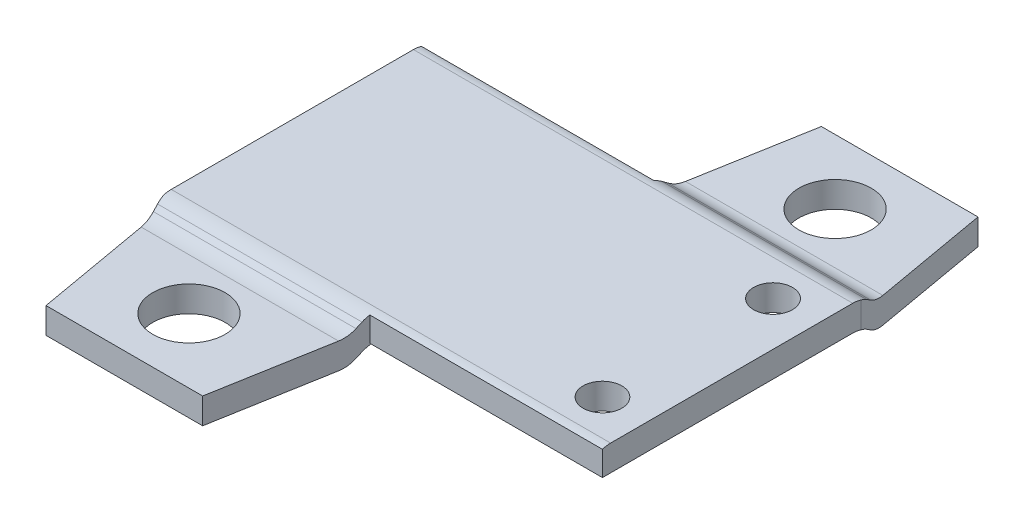
ISO-10303-21;
HEADER;
FILE_DESCRIPTION(('STEP AP214'),'2;1');
FILE_NAME('part.step','',(''),(''),'','','');
FILE_SCHEMA(('AUTOMOTIVE_DESIGN { 1 0 10303 214 1 1 1 1 }'));
ENDSEC;
DATA;
#1=APPLICATION_CONTEXT('core data for automotive mechanical design processes');
#2=APPLICATION_PROTOCOL_DEFINITION('international standard','automotive_design',2000,#1);
#3=PRODUCT_CONTEXT('',#1,'mechanical');
#4=PRODUCT('Part','Part','',(#3));
#5=PRODUCT_RELATED_PRODUCT_CATEGORY('part','',(#4));
#6=PRODUCT_DEFINITION_FORMATION('','',#4);
#7=PRODUCT_DEFINITION_CONTEXT('part definition',#1,'design');
#8=PRODUCT_DEFINITION('design','',#6,#7);
#9=PRODUCT_DEFINITION_SHAPE('','',#8);
#10=(LENGTH_UNIT() NAMED_UNIT(*) SI_UNIT(.MILLI.,.METRE.));
#11=(NAMED_UNIT(*) PLANE_ANGLE_UNIT() SI_UNIT($,.RADIAN.));
#12=(NAMED_UNIT(*) SI_UNIT($,.STERADIAN.) SOLID_ANGLE_UNIT());
#13=UNCERTAINTY_MEASURE_WITH_UNIT(LENGTH_MEASURE(1.E-05),#10,'distance_accuracy_value','');
#14=(GEOMETRIC_REPRESENTATION_CONTEXT(3) GLOBAL_UNCERTAINTY_ASSIGNED_CONTEXT((#13)) GLOBAL_UNIT_ASSIGNED_CONTEXT((#10,
#11,#12)) REPRESENTATION_CONTEXT('',''));
#15=CARTESIAN_POINT('',(0.,0.,0.));
#16=DIRECTION('',(0.,0.,1.));
#17=DIRECTION('',(1.,0.,0.));
#18=AXIS2_PLACEMENT_3D('',#15,#16,#17);
#19=CARTESIAN_POINT('',(-17.,-0.500000000000001,5.71407400337107));
#20=DIRECTION('',(0.,1.,0.));
#21=DIRECTION('',(0.,0.,1.));
#22=AXIS2_PLACEMENT_3D('',#19,#20,#21);
#23=PLANE('',#22);
#24=DIRECTION('',(-0.173648177666924,0.,-0.984807753012209));
#25=VECTOR('',#24,1.);
#26=CARTESIAN_POINT('',(-17.,-0.500000000000001,5.));
#27=LINE('',#26,#25);
#28=CARTESIAN_POINT('',(-16.8184938035191,-0.500000000000001,6.02937279225005));
#29=VERTEX_POINT('',#28);
#30=CARTESIAN_POINT('',(-16.0302016061035,-0.500000000000001,10.5));
#31=VERTEX_POINT('',#30);
#32=EDGE_CURVE('E307',#29,#31,#27,.F.);
#33=ORIENTED_EDGE('',*,*,#32,.T.);
#34=DIRECTION('',(1.,0.,0.));
#35=VECTOR('',#34,1.);
#36=CARTESIAN_POINT('',(-17.,-0.500000000000001,10.5));
#37=LINE('',#36,#35);
#38=CARTESIAN_POINT('',(-9.96979839389652,-0.500000000000001,10.5));
#39=VERTEX_POINT('',#38);
#40=EDGE_CURVE('E206',#39,#31,#37,.F.);
#41=ORIENTED_EDGE('',*,*,#40,.F.);
#42=DIRECTION('',(-0.173648177666924,0.,0.984807753012209));
#43=VECTOR('',#42,1.);
#44=CARTESIAN_POINT('',(-9.,-0.5,5.));
#45=LINE('',#44,#43);
#46=CARTESIAN_POINT('',(-9.18150619648088,-0.500000000000001,6.02937279225005));
#47=VERTEX_POINT('',#46);
#48=EDGE_CURVE('E311',#39,#47,#45,.F.);
#49=ORIENTED_EDGE('',*,*,#48,.T.);
#50=DIRECTION('',(-1.,0.,0.));
#51=VECTOR('',#50,1.);
#52=CARTESIAN_POINT('',(-17.,-0.500000000000001,6.02937279225005));
#53=LINE('',#52,#51);
#54=EDGE_CURVE('E270',#47,#29,#53,.T.);
#55=ORIENTED_EDGE('',*,*,#54,.T.);
#56=EDGE_LOOP('',(#33,#41,#49,#55));
#57=FACE_BOUND('',#56,.T.);
#58=CARTESIAN_POINT('',(-13.,-0.500000000000001,8.));
#59=DIRECTION('',(0.,1.,0.));
#60=DIRECTION('',(0.,0.,1.));
#61=AXIS2_PLACEMENT_3D('',#58,#59,#60);
#62=CIRCLE('',#61,1.4);
#63=CARTESIAN_POINT('',(-13.,-0.500000000000001,9.4));
#64=VERTEX_POINT('',#63);
#65=EDGE_CURVE('E20',#64,#64,#62,.F.);
#66=ORIENTED_EDGE('',*,*,#65,.T.);
#67=EDGE_LOOP('',(#66));
#68=FACE_BOUND('',#67,.T.);
#69=ADVANCED_FACE('F17',(#57,#68),#23,.T.);
#70=CARTESIAN_POINT('',(-13.,-1.5,8.));
#71=DIRECTION('',(0.,1.,0.));
#72=DIRECTION('',(0.,0.,1.));
#73=AXIS2_PLACEMENT_3D('',#70,#71,#72);
#74=CYLINDRICAL_SURFACE('',#73,1.4);
#75=ORIENTED_EDGE('',*,*,#65,.F.);
#76=EDGE_LOOP('',(#75));
#77=FACE_BOUND('',#76,.T.);
#78=CARTESIAN_POINT('',(-13.,-1.5,8.));
#79=DIRECTION('',(0.,1.,0.));
#80=DIRECTION('',(0.,0.,1.));
#81=AXIS2_PLACEMENT_3D('',#78,#79,#80);
#82=CIRCLE('',#81,1.4);
#83=CARTESIAN_POINT('',(-13.,-1.5,9.4));
#84=VERTEX_POINT('',#83);
#85=EDGE_CURVE('E263',#84,#84,#82,.T.);
#86=ORIENTED_EDGE('',*,*,#85,.F.);
#87=EDGE_LOOP('',(#86));
#88=FACE_BOUND('',#87,.T.);
#89=ADVANCED_FACE('F760',(#77,#88),#74,.F.);
#90=CARTESIAN_POINT('',(-17.,-1.5,5.));
#91=DIRECTION('',(0.984807753012209,0.,-0.173648177666924));
#92=DIRECTION('',(-0.173648177666924,0.,-0.984807753012209));
#93=AXIS2_PLACEMENT_3D('',#90,#91,#92);
#94=PLANE('',#93);
#95=CARTESIAN_POINT('',(-16.8184938035191,-0.500000000000002,6.02937279225005));
#96=DIRECTION('',(0.984807753012209,0.,-0.173648177666924));
#97=DIRECTION('',(0.173648177666924,0.,0.984807753012209));
#98=AXIS2_PLACEMENT_3D('',#95,#96,#97);
#99=ELLIPSE('',#98,1.01542661188574,1.);
#100=CARTESIAN_POINT('',(-16.8184938035191,-1.5,6.02937279225005));
#101=VERTEX_POINT('',#100);
#102=CARTESIAN_POINT('',(-16.9196308047464,-1.319152044289,5.45579635589901));
#103=VERTEX_POINT('',#102);
#104=EDGE_CURVE('E306',#101,#103,#99,.T.);
#105=ORIENTED_EDGE('',*,*,#104,.F.);
#106=DIRECTION('',(-0.173648177666924,0.,-0.984807753012209));
#107=VECTOR('',#106,1.);
#108=CARTESIAN_POINT('',(-16.0302016061035,-1.5,10.5));
#109=LINE('',#108,#107);
#110=CARTESIAN_POINT('',(-16.0302016061035,-1.5,10.5));
#111=VERTEX_POINT('',#110);
#112=EDGE_CURVE('E266',#111,#101,#109,.T.);
#113=ORIENTED_EDGE('',*,*,#112,.F.);
#114=DIRECTION('',(0.,1.,0.));
#115=VECTOR('',#114,1.);
#116=CARTESIAN_POINT('',(-16.0302016061035,-0.500000000000001,10.5));
#117=LINE('',#116,#115);
#118=EDGE_CURVE('E202',#31,#111,#117,.F.);
#119=ORIENTED_EDGE('',*,*,#118,.F.);
#120=ORIENTED_EDGE('',*,*,#32,.F.);
#121=CARTESIAN_POINT('',(-16.8184938035191,0.499999999999999,6.02937279225005));
#122=DIRECTION('',(0.984807753012209,0.,-0.173648177666924));
#123=DIRECTION('',(-0.173648177666924,0.,-0.984807753012209));
#124=AXIS2_PLACEMENT_3D('',#121,#122,#123);
#125=ELLIPSE('',#124,1.01542661188574,1.);
#126=CARTESIAN_POINT('',(-16.9196308047464,-0.319152044288996,5.45579635589901));
#127=VERTEX_POINT('',#126);
#128=EDGE_CURVE('E267',#29,#127,#125,.T.);
#129=ORIENTED_EDGE('',*,*,#128,.T.);
#130=DIRECTION('',(0.142955102962338,-0.56768533276981,0.810738676451949));
#131=VECTOR('',#130,1.);
#132=CARTESIAN_POINT('',(-16.9544586822368,-0.180847955711005,5.25827764747206));
#133=LINE('',#132,#131);
#134=CARTESIAN_POINT('',(-16.9544586822368,-0.180847955711005,5.25827764747206));
#135=VERTEX_POINT('',#134);
#136=EDGE_CURVE('E197',#135,#127,#133,.T.);
#137=ORIENTED_EDGE('',*,*,#136,.F.);
#138=CARTESIAN_POINT('',(-17.0555956834641,-1.,4.68470121112102));
#139=DIRECTION('',(0.984807753012209,0.,-0.173648177666924));
#140=DIRECTION('',(0.173648177666924,0.,0.984807753012209));
#141=AXIS2_PLACEMENT_3D('',#138,#139,#140);
#142=ELLIPSE('',#141,1.01542661188574,1.);
#143=CARTESIAN_POINT('',(-17.,-0.0510075481167025,4.99999999999996));
#144=VERTEX_POINT('',#143);
#145=EDGE_CURVE('E195',#144,#135,#142,.T.);
#146=ORIENTED_EDGE('',*,*,#145,.F.);
#147=DIRECTION('',(0.,1.,0.));
#148=VECTOR('',#147,1.);
#149=CARTESIAN_POINT('',(-17.,-1.5,4.99999999999996));
#150=LINE('',#149,#148);
#151=CARTESIAN_POINT('',(-17.,-1.0510075481167,4.99999999999996));
#152=VERTEX_POINT('',#151);
#153=EDGE_CURVE('E182',#152,#144,#150,.T.);
#154=ORIENTED_EDGE('',*,*,#153,.F.);
#155=CARTESIAN_POINT('',(-17.0555956834641,-2.,4.68470121112102));
#156=DIRECTION('',(0.984807753012209,0.,-0.173648177666924));
#157=DIRECTION('',(-0.173648177666924,0.,-0.984807753012209));
#158=AXIS2_PLACEMENT_3D('',#155,#156,#157);
#159=ELLIPSE('',#158,1.01542661188574,1.);
#160=CARTESIAN_POINT('',(-16.9544586822368,-1.18084795571101,5.25827764747206));
#161=VERTEX_POINT('',#160);
#162=EDGE_CURVE('E173',#161,#152,#159,.F.);
#163=ORIENTED_EDGE('',*,*,#162,.F.);
#164=DIRECTION('',(-0.142955102962338,0.56768533276981,-0.810738676451949));
#165=VECTOR('',#164,1.);
#166=CARTESIAN_POINT('',(-16.9196308047464,-1.319152044289,5.45579635589901));
#167=LINE('',#166,#165);
#168=EDGE_CURVE('E168',#103,#161,#167,.T.);
#169=ORIENTED_EDGE('',*,*,#168,.F.);
#170=EDGE_LOOP('',(#105,#113,#119,#120,#129,#137,#146,#154,#163,#169));
#171=FACE_BOUND('',#170,.T.);
#172=ADVANCED_FACE('F193',(#171),#94,.F.);
#173=CARTESIAN_POINT('',(-9.,-1.5,5.));
#174=DIRECTION('',(-0.984807753012209,0.,-0.173648177666924));
#175=DIRECTION('',(-0.173648177666924,0.,0.984807753012209));
#176=AXIS2_PLACEMENT_3D('',#173,#174,#175);
#177=PLANE('',#176);
#178=CARTESIAN_POINT('',(-9.18150619648088,-0.500000000000002,6.02937279225005));
#179=DIRECTION('',(-0.984807753012209,0.,-0.173648177666924));
#180=DIRECTION('',(0.173648177666924,0.,-0.984807753012209));
#181=AXIS2_PLACEMENT_3D('',#178,#179,#180);
#182=ELLIPSE('',#181,1.01542661188574,1.);
#183=CARTESIAN_POINT('',(-9.08036919525358,-1.319152044289,5.45579635589901));
#184=VERTEX_POINT('',#183);
#185=CARTESIAN_POINT('',(-9.18150619648088,-1.5,6.02937279225005));
#186=VERTEX_POINT('',#185);
#187=EDGE_CURVE('E296',#184,#186,#182,.T.);
#188=ORIENTED_EDGE('',*,*,#187,.F.);
#189=DIRECTION('',(-0.142955102962344,-0.567685332769808,0.810738676451949));
#190=VECTOR('',#189,1.);
#191=CARTESIAN_POINT('',(-9.04554131776323,-1.18084795571101,5.25827764747206));
#192=LINE('',#191,#190);
#193=CARTESIAN_POINT('',(-9.04554131776323,-1.18084795571101,5.25827764747206));
#194=VERTEX_POINT('',#193);
#195=EDGE_CURVE('E298',#194,#184,#192,.T.);
#196=ORIENTED_EDGE('',*,*,#195,.F.);
#197=CARTESIAN_POINT('',(-8.94440431653593,-2.,4.68470121112102));
#198=DIRECTION('',(-0.984807753012209,0.,-0.173648177666924));
#199=DIRECTION('',(-0.173648177666924,0.,0.984807753012209));
#200=AXIS2_PLACEMENT_3D('',#197,#198,#199);
#201=ELLIPSE('',#200,1.01542661188574,1.);
#202=CARTESIAN_POINT('',(-8.94440431653593,-1.,4.68470121112102));
#203=VERTEX_POINT('',#202);
#204=EDGE_CURVE('E299',#203,#194,#201,.F.);
#205=ORIENTED_EDGE('',*,*,#204,.F.);
#206=DIRECTION('',(-0.173648177666924,0.,0.984807753012209));
#207=VECTOR('',#206,1.);
#208=CARTESIAN_POINT('',(-9.,-1.,5.));
#209=LINE('',#208,#207);
#210=CARTESIAN_POINT('',(-9.,-1.,5.));
#211=VERTEX_POINT('',#210);
#212=EDGE_CURVE('E301',#211,#203,#209,.F.);
#213=ORIENTED_EDGE('',*,*,#212,.F.);
#214=DIRECTION('',(0.,1.,0.));
#215=VECTOR('',#214,1.);
#216=CARTESIAN_POINT('',(-9.,-1.5,5.));
#217=LINE('',#216,#215);
#218=CARTESIAN_POINT('',(-9.,-0.0510075481167152,5.));
#219=VERTEX_POINT('',#218);
#220=EDGE_CURVE('E304',#219,#211,#217,.F.);
#221=ORIENTED_EDGE('',*,*,#220,.F.);
#222=CARTESIAN_POINT('',(-8.94440431653593,-1.,4.68470121112102));
#223=DIRECTION('',(-0.984807753012209,0.,-0.173648177666924));
#224=DIRECTION('',(0.173648177666924,0.,-0.984807753012209));
#225=AXIS2_PLACEMENT_3D('',#222,#223,#224);
#226=ELLIPSE('',#225,1.01542661188574,1.);
#227=CARTESIAN_POINT('',(-9.04554131776323,-0.180847955711004,5.25827764747206));
#228=VERTEX_POINT('',#227);
#229=EDGE_CURVE('E302',#228,#219,#226,.T.);
#230=ORIENTED_EDGE('',*,*,#229,.F.);
#231=DIRECTION('',(0.142955102962344,0.567685332769808,-0.810738676451949));
#232=VECTOR('',#231,1.);
#233=CARTESIAN_POINT('',(-9.08036919525359,-0.319152044288995,5.45579635589901));
#234=LINE('',#233,#232);
#235=CARTESIAN_POINT('',(-9.08036919525358,-0.319152044288996,5.45579635589901));
#236=VERTEX_POINT('',#235);
#237=EDGE_CURVE('E305',#236,#228,#234,.T.);
#238=ORIENTED_EDGE('',*,*,#237,.F.);
#239=CARTESIAN_POINT('',(-9.18150619648088,0.499999999999999,6.02937279225005));
#240=DIRECTION('',(-0.984807753012209,0.,-0.173648177666924));
#241=DIRECTION('',(-0.173648177666924,0.,0.984807753012209));
#242=AXIS2_PLACEMENT_3D('',#239,#240,#241);
#243=ELLIPSE('',#242,1.01542661188574,1.);
#244=EDGE_CURVE('E271',#236,#47,#243,.T.);
#245=ORIENTED_EDGE('',*,*,#244,.T.);
#246=ORIENTED_EDGE('',*,*,#48,.F.);
#247=DIRECTION('',(0.,1.,0.));
#248=VECTOR('',#247,1.);
#249=CARTESIAN_POINT('',(-9.96979839389652,-0.500000000000001,10.5));
#250=LINE('',#249,#248);
#251=CARTESIAN_POINT('',(-9.96979839389652,-1.5,10.5));
#252=VERTEX_POINT('',#251);
#253=EDGE_CURVE('E218',#252,#39,#250,.T.);
#254=ORIENTED_EDGE('',*,*,#253,.F.);
#255=DIRECTION('',(-0.173648177666924,0.,0.984807753012209));
#256=VECTOR('',#255,1.);
#257=CARTESIAN_POINT('',(-9.18150619648088,-1.5,6.02937279225005));
#258=LINE('',#257,#256);
#259=EDGE_CURVE('E330',#186,#252,#258,.T.);
#260=ORIENTED_EDGE('',*,*,#259,.F.);
#261=EDGE_LOOP('',(#188,#196,#205,#213,#221,#230,#238,#245,#246,#254,#260));
#262=FACE_BOUND('',#261,.T.);
#263=ADVANCED_FACE('F508',(#262),#177,.F.);
#264=CARTESIAN_POINT('',(-17.,-0.500000000000001,10.5));
#265=DIRECTION('',(0.,0.,1.));
#266=DIRECTION('',(1.,0.,0.));
#267=AXIS2_PLACEMENT_3D('',#264,#265,#266);
#268=PLANE('',#267);
#269=ORIENTED_EDGE('',*,*,#118,.T.);
#270=DIRECTION('',(1.,0.,0.));
#271=VECTOR('',#270,1.);
#272=CARTESIAN_POINT('',(-17.,-1.5,10.5));
#273=LINE('',#272,#271);
#274=EDGE_CURVE('E327',#252,#111,#273,.F.);
#275=ORIENTED_EDGE('',*,*,#274,.F.);
#276=ORIENTED_EDGE('',*,*,#253,.T.);
#277=ORIENTED_EDGE('',*,*,#40,.T.);
#278=EDGE_LOOP('',(#269,#275,#276,#277));
#279=FACE_BOUND('',#278,.T.);
#280=ADVANCED_FACE('F515',(#279),#268,.T.);
#281=CARTESIAN_POINT('',(-17.,-0.500000000000001,-5.71407400337106));
#282=DIRECTION('',(0.,1.,0.));
#283=DIRECTION('',(0.,0.,1.));
#284=AXIS2_PLACEMENT_3D('',#281,#282,#283);
#285=PLANE('',#284);
#286=CARTESIAN_POINT('',(-4.,-0.500000000000001,-8.));
#287=DIRECTION('',(0.,1.,0.));
#288=DIRECTION('',(0.,0.,1.));
#289=AXIS2_PLACEMENT_3D('',#286,#287,#288);
#290=CIRCLE('',#289,1.4);
#291=CARTESIAN_POINT('',(-4.,-0.500000000000001,-6.6));
#292=VERTEX_POINT('',#291);
#293=EDGE_CURVE('E212',#292,#292,#290,.F.);
#294=ORIENTED_EDGE('',*,*,#293,.T.);
#295=EDGE_LOOP('',(#294));
#296=FACE_BOUND('',#295,.T.);
#297=DIRECTION('',(0.173648177666931,0.,0.984807753012208));
#298=VECTOR('',#297,1.);
#299=CARTESIAN_POINT('',(0.,-0.5,-5.));
#300=LINE('',#299,#298);
#301=CARTESIAN_POINT('',(-0.181506196480896,-0.500000000000001,-6.02937279225004));
#302=VERTEX_POINT('',#301);
#303=CARTESIAN_POINT('',(-0.969798393896562,-0.5,-10.5));
#304=VERTEX_POINT('',#303);
#305=EDGE_CURVE('E290',#302,#304,#300,.F.);
#306=ORIENTED_EDGE('',*,*,#305,.T.);
#307=DIRECTION('',(-1.,0.,0.));
#308=VECTOR('',#307,1.);
#309=CARTESIAN_POINT('',(-17.,-0.5,-10.5));
#310=LINE('',#309,#308);
#311=CARTESIAN_POINT('',(-7.03020160610344,-0.5,-10.5));
#312=VERTEX_POINT('',#311);
#313=EDGE_CURVE('E209',#312,#304,#310,.F.);
#314=ORIENTED_EDGE('',*,*,#313,.F.);
#315=DIRECTION('',(0.173648177666931,0.,-0.984807753012208));
#316=VECTOR('',#315,1.);
#317=CARTESIAN_POINT('',(-8.,-0.5,-5.));
#318=LINE('',#317,#316);
#319=CARTESIAN_POINT('',(-7.81849380351911,-0.5,-6.02937279225004));
#320=VERTEX_POINT('',#319);
#321=EDGE_CURVE('E354',#312,#320,#318,.F.);
#322=ORIENTED_EDGE('',*,*,#321,.T.);
#323=DIRECTION('',(-1.,0.,0.));
#324=VECTOR('',#323,1.);
#325=CARTESIAN_POINT('',(-17.,-0.500000000000001,-6.02937279225004));
#326=LINE('',#325,#324);
#327=EDGE_CURVE('E262',#320,#302,#326,.F.);
#328=ORIENTED_EDGE('',*,*,#327,.T.);
#329=EDGE_LOOP('',(#306,#314,#322,#328));
#330=FACE_BOUND('',#329,.T.);
#331=ADVANCED_FACE('F566',(#296,#330),#285,.T.);
#332=CARTESIAN_POINT('',(0.,-1.5,-5.));
#333=DIRECTION('',(-0.984807753012208,0.,0.173648177666931));
#334=DIRECTION('',(0.173648177666931,0.,0.984807753012208));
#335=AXIS2_PLACEMENT_3D('',#332,#333,#334);
#336=PLANE('',#335);
#337=CARTESIAN_POINT('',(-0.181506196480895,-0.500000000000001,-6.02937279225004));
#338=DIRECTION('',(-0.984807753012208,0.,0.173648177666931));
#339=DIRECTION('',(0.173648177666931,0.,0.984807753012208));
#340=AXIS2_PLACEMENT_3D('',#337,#338,#339);
#341=ELLIPSE('',#340,1.01542661188575,1.);
#342=CARTESIAN_POINT('',(-0.181506196480894,-1.5,-6.02937279225004));
#343=VERTEX_POINT('',#342);
#344=CARTESIAN_POINT('',(-0.0803691952535917,-1.31915204428899,-5.45579635589899));
#345=VERTEX_POINT('',#344);
#346=EDGE_CURVE('E287',#343,#345,#341,.T.);
#347=ORIENTED_EDGE('',*,*,#346,.F.);
#348=DIRECTION('',(0.173648177666931,0.,0.984807753012208));
#349=VECTOR('',#348,1.);
#350=CARTESIAN_POINT('',(-0.969798393896562,-1.5,-10.5));
#351=LINE('',#350,#349);
#352=CARTESIAN_POINT('',(-0.969798393896562,-1.5,-10.5));
#353=VERTEX_POINT('',#352);
#354=EDGE_CURVE('E258',#353,#343,#351,.T.);
#355=ORIENTED_EDGE('',*,*,#354,.F.);
#356=DIRECTION('',(0.,1.,0.));
#357=VECTOR('',#356,1.);
#358=CARTESIAN_POINT('',(-0.969798393896562,-0.500000000000001,-10.5));
#359=LINE('',#358,#357);
#360=EDGE_CURVE('E278',#304,#353,#359,.F.);
#361=ORIENTED_EDGE('',*,*,#360,.F.);
#362=ORIENTED_EDGE('',*,*,#305,.F.);
#363=CARTESIAN_POINT('',(-0.181506196480895,0.499999999999999,-6.02937279225004));
#364=DIRECTION('',(-0.984807753012208,0.,0.173648177666931));
#365=DIRECTION('',(-0.173648177666931,0.,-0.984807753012208));
#366=AXIS2_PLACEMENT_3D('',#363,#364,#365);
#367=ELLIPSE('',#366,1.01542661188575,1.);
#368=CARTESIAN_POINT('',(-0.0803691952535929,-0.319152044288991,-5.45579635589899));
#369=VERTEX_POINT('',#368);
#370=EDGE_CURVE('E259',#302,#369,#367,.T.);
#371=ORIENTED_EDGE('',*,*,#370,.T.);
#372=DIRECTION('',(-0.142955102962349,-0.567685332769815,-0.810738676451943));
#373=VECTOR('',#372,1.);
#374=CARTESIAN_POINT('',(-0.0455413177632345,-0.180847955711009,-5.25827764747206));
#375=LINE('',#374,#373);
#376=CARTESIAN_POINT('',(-0.0455413177632335,-0.180847955711009,-5.25827764747206));
#377=VERTEX_POINT('',#376);
#378=EDGE_CURVE('E293',#377,#369,#375,.T.);
#379=ORIENTED_EDGE('',*,*,#378,.F.);
#380=CARTESIAN_POINT('',(0.0555956834640686,-1.,-4.68470121112102));
#381=DIRECTION('',(-0.984807753012208,0.,0.173648177666931));
#382=DIRECTION('',(0.173648177666931,0.,0.984807753012208));
#383=AXIS2_PLACEMENT_3D('',#380,#381,#382);
#384=ELLIPSE('',#383,1.01542661188575,1.);
#385=CARTESIAN_POINT('',(0.,-0.0510075481167179,-5.));
#386=VERTEX_POINT('',#385);
#387=EDGE_CURVE('E291',#386,#377,#384,.T.);
#388=ORIENTED_EDGE('',*,*,#387,.F.);
#389=DIRECTION('',(0.,1.,0.));
#390=VECTOR('',#389,1.);
#391=CARTESIAN_POINT('',(0.,-1.5,-5.));
#392=LINE('',#391,#390);
#393=CARTESIAN_POINT('',(0.,-1.05100754811672,-5.));
#394=VERTEX_POINT('',#393);
#395=EDGE_CURVE('E294',#394,#386,#392,.T.);
#396=ORIENTED_EDGE('',*,*,#395,.F.);
#397=CARTESIAN_POINT('',(0.0555956834640686,-2.,-4.68470121112102));
#398=DIRECTION('',(-0.984807753012208,0.,0.173648177666931));
#399=DIRECTION('',(-0.173648177666931,0.,-0.984807753012208));
#400=AXIS2_PLACEMENT_3D('',#397,#398,#399);
#401=ELLIPSE('',#400,1.01542661188575,1.);
#402=CARTESIAN_POINT('',(-0.0455413177632338,-1.18084795571101,-5.25827764747206));
#403=VERTEX_POINT('',#402);
#404=EDGE_CURVE('E205',#403,#394,#401,.F.);
#405=ORIENTED_EDGE('',*,*,#404,.F.);
#406=DIRECTION('',(0.142955102962349,0.567685332769813,0.810738676451944));
#407=VECTOR('',#406,1.);
#408=CARTESIAN_POINT('',(-0.080369195253591,-1.31915204428899,-5.45579635589899));
#409=LINE('',#408,#407);
#410=EDGE_CURVE('E289',#345,#403,#409,.T.);
#411=ORIENTED_EDGE('',*,*,#410,.F.);
#412=EDGE_LOOP('',(#347,#355,#361,#362,#371,#379,#388,#396,#405,#411));
#413=FACE_BOUND('',#412,.T.);
#414=ADVANCED_FACE('F485',(#413),#336,.F.);
#415=CARTESIAN_POINT('',(-8.,-1.5,-5.));
#416=DIRECTION('',(0.984807753012208,0.,0.173648177666931));
#417=DIRECTION('',(0.173648177666931,0.,-0.984807753012208));
#418=AXIS2_PLACEMENT_3D('',#415,#416,#417);
#419=PLANE('',#418);
#420=CARTESIAN_POINT('',(-7.81849380351911,-0.500000000000001,-6.02937279225004));
#421=DIRECTION('',(0.984807753012208,0.,0.173648177666931));
#422=DIRECTION('',(0.173648177666931,0.,-0.984807753012208));
#423=AXIS2_PLACEMENT_3D('',#420,#421,#422);
#424=ELLIPSE('',#423,1.01542661188575,1.);
#425=CARTESIAN_POINT('',(-7.91963080474641,-1.31915204428899,-5.45579635589899));
#426=VERTEX_POINT('',#425);
#427=CARTESIAN_POINT('',(-7.81849380351911,-1.5,-6.02937279225004));
#428=VERTEX_POINT('',#427);
#429=EDGE_CURVE('E276',#426,#428,#424,.T.);
#430=ORIENTED_EDGE('',*,*,#429,.F.);
#431=DIRECTION('',(0.142955102962354,-0.567685332769816,-0.810738676451942));
#432=VECTOR('',#431,1.);
#433=CARTESIAN_POINT('',(-7.95445868223677,-1.18084795571101,-5.25827764747206));
#434=LINE('',#433,#432);
#435=CARTESIAN_POINT('',(-7.95445868223677,-1.18084795571101,-5.25827764747206));
#436=VERTEX_POINT('',#435);
#437=EDGE_CURVE('E279',#436,#426,#434,.T.);
#438=ORIENTED_EDGE('',*,*,#437,.F.);
#439=CARTESIAN_POINT('',(-8.05559568346407,-2.,-4.68470121112102));
#440=DIRECTION('',(0.984807753012208,0.,0.173648177666931));
#441=DIRECTION('',(-0.173648177666931,0.,0.984807753012208));
#442=AXIS2_PLACEMENT_3D('',#439,#440,#441);
#443=ELLIPSE('',#442,1.01542661188575,1.);
#444=CARTESIAN_POINT('',(-8.05559568346407,-1.,-4.68470121112102));
#445=VERTEX_POINT('',#444);
#446=EDGE_CURVE('E280',#445,#436,#443,.F.);
#447=ORIENTED_EDGE('',*,*,#446,.F.);
#448=DIRECTION('',(0.173648177666931,0.,-0.984807753012208));
#449=VECTOR('',#448,1.);
#450=CARTESIAN_POINT('',(-8.,-1.,-5.));
#451=LINE('',#450,#449);
#452=CARTESIAN_POINT('',(-8.,-1.,-5.));
#453=VERTEX_POINT('',#452);
#454=EDGE_CURVE('E282',#453,#445,#451,.F.);
#455=ORIENTED_EDGE('',*,*,#454,.F.);
#456=DIRECTION('',(0.,1.,0.));
#457=VECTOR('',#456,1.);
#458=CARTESIAN_POINT('',(-8.,-1.5,-5.));
#459=LINE('',#458,#457);
#460=CARTESIAN_POINT('',(-8.,-0.0510075481167167,-5.));
#461=VERTEX_POINT('',#460);
#462=EDGE_CURVE('E285',#461,#453,#459,.F.);
#463=ORIENTED_EDGE('',*,*,#462,.F.);
#464=CARTESIAN_POINT('',(-8.05559568346407,-1.,-4.68470121112102));
#465=DIRECTION('',(0.984807753012208,0.,0.173648177666931));
#466=DIRECTION('',(0.173648177666931,0.,-0.984807753012208));
#467=AXIS2_PLACEMENT_3D('',#464,#465,#466);
#468=ELLIPSE('',#467,1.01542661188575,1.);
#469=CARTESIAN_POINT('',(-7.95445868223677,-0.180847955711008,-5.25827764747206));
#470=VERTEX_POINT('',#469);
#471=EDGE_CURVE('E283',#470,#461,#468,.T.);
#472=ORIENTED_EDGE('',*,*,#471,.F.);
#473=DIRECTION('',(-0.142955102962354,0.567685332769813,0.810738676451944));
#474=VECTOR('',#473,1.);
#475=CARTESIAN_POINT('',(-7.91963080474641,-0.319152044288991,-5.45579635589899));
#476=LINE('',#475,#474);
#477=CARTESIAN_POINT('',(-7.91963080474641,-0.319152044288992,-5.45579635589899));
#478=VERTEX_POINT('',#477);
#479=EDGE_CURVE('E286',#478,#470,#476,.T.);
#480=ORIENTED_EDGE('',*,*,#479,.F.);
#481=CARTESIAN_POINT('',(-7.81849380351911,0.499999999999999,-6.02937279225004));
#482=DIRECTION('',(0.984807753012208,0.,0.173648177666931));
#483=DIRECTION('',(-0.173648177666931,0.,0.984807753012208));
#484=AXIS2_PLACEMENT_3D('',#481,#482,#483);
#485=ELLIPSE('',#484,1.01542661188575,1.);
#486=EDGE_CURVE('E255',#478,#320,#485,.T.);
#487=ORIENTED_EDGE('',*,*,#486,.T.);
#488=ORIENTED_EDGE('',*,*,#321,.F.);
#489=DIRECTION('',(0.,1.,0.));
#490=VECTOR('',#489,1.);
#491=CARTESIAN_POINT('',(-7.03020160610344,-0.500000000000001,-10.5));
#492=LINE('',#491,#490);
#493=CARTESIAN_POINT('',(-7.03020160610344,-1.5,-10.5));
#494=VERTEX_POINT('',#493);
#495=EDGE_CURVE('E213',#494,#312,#492,.T.);
#496=ORIENTED_EDGE('',*,*,#495,.F.);
#497=DIRECTION('',(0.173648177666931,0.,-0.984807753012208));
#498=VECTOR('',#497,1.);
#499=CARTESIAN_POINT('',(-7.81849380351911,-1.5,-6.02937279225004));
#500=LINE('',#499,#498);
#501=EDGE_CURVE('E363',#428,#494,#500,.T.);
#502=ORIENTED_EDGE('',*,*,#501,.F.);
#503=EDGE_LOOP('',(#430,#438,#447,#455,#463,#472,#480,#487,#488,#496,#502));
#504=FACE_BOUND('',#503,.T.);
#505=ADVANCED_FACE('F473',(#504),#419,.F.);
#506=CARTESIAN_POINT('',(-17.,-0.500000000000001,-10.5));
#507=DIRECTION('',(0.,0.,-1.));
#508=DIRECTION('',(-1.,0.,0.));
#509=AXIS2_PLACEMENT_3D('',#506,#507,#508);
#510=PLANE('',#509);
#511=ORIENTED_EDGE('',*,*,#495,.T.);
#512=ORIENTED_EDGE('',*,*,#313,.T.);
#513=ORIENTED_EDGE('',*,*,#360,.T.);
#514=DIRECTION('',(1.,0.,0.));
#515=VECTOR('',#514,1.);
#516=CARTESIAN_POINT('',(-17.,-1.5,-10.5));
#517=LINE('',#516,#515);
#518=EDGE_CURVE('E254',#494,#353,#517,.T.);
#519=ORIENTED_EDGE('',*,*,#518,.F.);
#520=EDGE_LOOP('',(#511,#512,#513,#519));
#521=FACE_BOUND('',#520,.T.);
#522=ADVANCED_FACE('F493',(#521),#510,.T.);
#523=CARTESIAN_POINT('',(-4.,-1.5,-8.));
#524=DIRECTION('',(0.,1.,0.));
#525=DIRECTION('',(0.,0.,1.));
#526=AXIS2_PLACEMENT_3D('',#523,#524,#525);
#527=CYLINDRICAL_SURFACE('',#526,1.4);
#528=ORIENTED_EDGE('',*,*,#293,.F.);
#529=EDGE_LOOP('',(#528));
#530=FACE_BOUND('',#529,.T.);
#531=CARTESIAN_POINT('',(-4.,-1.5,-8.));
#532=DIRECTION('',(0.,1.,0.));
#533=DIRECTION('',(0.,0.,1.));
#534=AXIS2_PLACEMENT_3D('',#531,#532,#533);
#535=CIRCLE('',#534,1.4);
#536=CARTESIAN_POINT('',(-4.,-1.5,-6.6));
#537=VERTEX_POINT('',#536);
#538=EDGE_CURVE('E250',#537,#537,#535,.T.);
#539=ORIENTED_EDGE('',*,*,#538,.F.);
#540=EDGE_LOOP('',(#539));
#541=FACE_BOUND('',#540,.T.);
#542=ADVANCED_FACE('F629',(#530,#541),#527,.F.);
#543=CARTESIAN_POINT('',(-17.,0.499999999999999,6.02937279225005));
#544=DIRECTION('',(-1.,0.,0.));
#545=DIRECTION('',(0.,0.,1.));
#546=AXIS2_PLACEMENT_3D('',#543,#544,#545);
#547=CYLINDRICAL_SURFACE('',#546,1.);
#548=ORIENTED_EDGE('',*,*,#54,.F.);
#549=ORIENTED_EDGE('',*,*,#244,.F.);
#550=DIRECTION('',(1.,0.,0.));
#551=VECTOR('',#550,1.);
#552=CARTESIAN_POINT('',(-17.,-0.319152044288996,5.45579635589901));
#553=LINE('',#552,#551);
#554=EDGE_CURVE('E253',#127,#236,#553,.T.);
#555=ORIENTED_EDGE('',*,*,#554,.F.);
#556=ORIENTED_EDGE('',*,*,#128,.F.);
#557=EDGE_LOOP('',(#548,#549,#555,#556));
#558=FACE_BOUND('',#557,.T.);
#559=ADVANCED_FACE('F527',(#558),#547,.F.);
#560=CARTESIAN_POINT('',(-17.,-1.5,5.71407400337107));
#561=DIRECTION('',(0.,-1.,0.));
#562=DIRECTION('',(0.,0.,-1.));
#563=AXIS2_PLACEMENT_3D('',#560,#561,#562);
#564=PLANE('',#563);
#565=ORIENTED_EDGE('',*,*,#259,.T.);
#566=ORIENTED_EDGE('',*,*,#274,.T.);
#567=ORIENTED_EDGE('',*,*,#112,.T.);
#568=DIRECTION('',(1.,0.,0.));
#569=VECTOR('',#568,1.);
#570=CARTESIAN_POINT('',(-17.,-1.5,6.02937279225005));
#571=LINE('',#570,#569);
#572=EDGE_CURVE('E378',#186,#101,#571,.F.);
#573=ORIENTED_EDGE('',*,*,#572,.F.);
#574=EDGE_LOOP('',(#565,#566,#567,#573));
#575=FACE_BOUND('',#574,.T.);
#576=ORIENTED_EDGE('',*,*,#85,.T.);
#577=EDGE_LOOP('',(#576));
#578=FACE_BOUND('',#577,.T.);
#579=ADVANCED_FACE('F518',(#575,#578),#564,.T.);
#580=CARTESIAN_POINT('',(-17.,0.499999999999999,-6.02937279225004));
#581=DIRECTION('',(-1.,0.,0.));
#582=DIRECTION('',(0.,0.,1.));
#583=AXIS2_PLACEMENT_3D('',#580,#581,#582);
#584=CYLINDRICAL_SURFACE('',#583,1.);
#585=DIRECTION('',(1.,0.,0.));
#586=VECTOR('',#585,1.);
#587=CARTESIAN_POINT('',(-17.,-0.319152044288991,-5.45579635589899));
#588=LINE('',#587,#586);
#589=EDGE_CURVE('E388',#369,#478,#588,.F.);
#590=ORIENTED_EDGE('',*,*,#589,.F.);
#591=ORIENTED_EDGE('',*,*,#370,.F.);
#592=ORIENTED_EDGE('',*,*,#327,.F.);
#593=ORIENTED_EDGE('',*,*,#486,.F.);
#594=EDGE_LOOP('',(#590,#591,#592,#593));
#595=FACE_BOUND('',#594,.T.);
#596=ADVANCED_FACE('F563',(#595),#584,.F.);
#597=CARTESIAN_POINT('',(-17.,-1.5,-10.5));
#598=DIRECTION('',(0.,-1.,0.));
#599=DIRECTION('',(0.,0.,-1.));
#600=AXIS2_PLACEMENT_3D('',#597,#598,#599);
#601=PLANE('',#600);
#602=ORIENTED_EDGE('',*,*,#538,.T.);
#603=EDGE_LOOP('',(#602));
#604=FACE_BOUND('',#603,.T.);
#605=ORIENTED_EDGE('',*,*,#501,.T.);
#606=ORIENTED_EDGE('',*,*,#518,.T.);
#607=ORIENTED_EDGE('',*,*,#354,.T.);
#608=DIRECTION('',(1.,0.,0.));
#609=VECTOR('',#608,1.);
#610=CARTESIAN_POINT('',(-17.,-1.5,-6.02937279225004));
#611=LINE('',#610,#609);
#612=EDGE_CURVE('E391',#428,#343,#611,.T.);
#613=ORIENTED_EDGE('',*,*,#612,.F.);
#614=EDGE_LOOP('',(#605,#606,#607,#613));
#615=FACE_BOUND('',#614,.T.);
#616=ADVANCED_FACE('F489',(#604,#615),#601,.T.);
#617=CARTESIAN_POINT('',(-17.,0.,5.));
#618=DIRECTION('',(0.,0.819152044288995,0.573576436351041));
#619=DIRECTION('',(0.,-0.573576436351041,0.819152044288995));
#620=AXIS2_PLACEMENT_3D('',#617,#618,#619);
#621=PLANE('',#620);
#622=ORIENTED_EDGE('',*,*,#237,.T.);
#623=DIRECTION('',(1.,0.,0.));
#624=VECTOR('',#623,1.);
#625=CARTESIAN_POINT('',(-17.,-0.180847955711005,5.25827764747206));
#626=LINE('',#625,#624);
#627=EDGE_CURVE('E249',#135,#228,#626,.T.);
#628=ORIENTED_EDGE('',*,*,#627,.F.);
#629=ORIENTED_EDGE('',*,*,#136,.T.);
#630=ORIENTED_EDGE('',*,*,#554,.T.);
#631=EDGE_LOOP('',(#622,#628,#629,#630));
#632=FACE_BOUND('',#631,.T.);
#633=ADVANCED_FACE('F529',(#632),#621,.T.);
#634=CARTESIAN_POINT('',(-17.,-0.500000000000002,6.02937279225005));
#635=DIRECTION('',(1.,0.,0.));
#636=DIRECTION('',(0.,0.,-1.));
#637=AXIS2_PLACEMENT_3D('',#634,#635,#636);
#638=CYLINDRICAL_SURFACE('',#637,1.);
#639=ORIENTED_EDGE('',*,*,#187,.T.);
#640=ORIENTED_EDGE('',*,*,#572,.T.);
#641=ORIENTED_EDGE('',*,*,#104,.T.);
#642=DIRECTION('',(1.,0.,0.));
#643=VECTOR('',#642,1.);
#644=CARTESIAN_POINT('',(-17.,-1.319152044289,5.45579635589901));
#645=LINE('',#644,#643);
#646=EDGE_CURVE('E244',#184,#103,#645,.F.);
#647=ORIENTED_EDGE('',*,*,#646,.F.);
#648=EDGE_LOOP('',(#639,#640,#641,#647));
#649=FACE_BOUND('',#648,.T.);
#650=ADVANCED_FACE('F522',(#649),#638,.T.);
#651=CARTESIAN_POINT('',(-17.,0.,-5.));
#652=DIRECTION('',(0.,0.819152044288991,-0.573576436351048));
#653=DIRECTION('',(0.,0.573576436351048,0.819152044288991));
#654=AXIS2_PLACEMENT_3D('',#651,#652,#653);
#655=PLANE('',#654);
#656=ORIENTED_EDGE('',*,*,#479,.T.);
#657=DIRECTION('',(1.,0.,0.));
#658=VECTOR('',#657,1.);
#659=CARTESIAN_POINT('',(-17.,-0.180847955711009,-5.25827764747206));
#660=LINE('',#659,#658);
#661=EDGE_CURVE('E243',#377,#470,#660,.F.);
#662=ORIENTED_EDGE('',*,*,#661,.F.);
#663=ORIENTED_EDGE('',*,*,#378,.T.);
#664=ORIENTED_EDGE('',*,*,#589,.T.);
#665=EDGE_LOOP('',(#656,#662,#663,#664));
#666=FACE_BOUND('',#665,.T.);
#667=ADVANCED_FACE('F557',(#666),#655,.T.);
#668=CARTESIAN_POINT('',(-17.,-0.500000000000001,-6.02937279225004));
#669=DIRECTION('',(1.,0.,0.));
#670=DIRECTION('',(0.,0.,-1.));
#671=AXIS2_PLACEMENT_3D('',#668,#669,#670);
#672=CYLINDRICAL_SURFACE('',#671,1.);
#673=ORIENTED_EDGE('',*,*,#346,.T.);
#674=DIRECTION('',(1.,0.,0.));
#675=VECTOR('',#674,1.);
#676=CARTESIAN_POINT('',(-17.,-1.31915204428899,-5.45579635589899));
#677=LINE('',#676,#675);
#678=EDGE_CURVE('E403',#426,#345,#677,.T.);
#679=ORIENTED_EDGE('',*,*,#678,.F.);
#680=ORIENTED_EDGE('',*,*,#429,.T.);
#681=ORIENTED_EDGE('',*,*,#612,.T.);
#682=EDGE_LOOP('',(#673,#679,#680,#681));
#683=FACE_BOUND('',#682,.T.);
#684=ADVANCED_FACE('F481',(#683),#672,.T.);
#685=CARTESIAN_POINT('',(-17.,-1.,4.68470121112102));
#686=DIRECTION('',(1.,0.,0.));
#687=DIRECTION('',(0.,0.,-1.));
#688=AXIS2_PLACEMENT_3D('',#685,#686,#687);
#689=CYLINDRICAL_SURFACE('',#688,1.);
#690=DIRECTION('',(1.,0.,0.));
#691=VECTOR('',#690,1.);
#692=CARTESIAN_POINT('',(-17.,0.,4.68470121112102));
#693=LINE('',#692,#691);
#694=CARTESIAN_POINT('',(-17.,0.,4.68470121112102));
#695=VERTEX_POINT('',#694);
#696=CARTESIAN_POINT('',(0.,0.,4.68470121112102));
#697=VERTEX_POINT('',#696);
#698=EDGE_CURVE('E239',#695,#697,#693,.T.);
#699=ORIENTED_EDGE('',*,*,#698,.F.);
#700=CARTESIAN_POINT('',(-17.,-1.,4.68470121112102));
#701=DIRECTION('',(1.,0.,0.));
#702=DIRECTION('',(0.,0.,-1.));
#703=AXIS2_PLACEMENT_3D('',#700,#701,#702);
#704=CIRCLE('',#703,1.);
#705=EDGE_CURVE('E245',#695,#144,#704,.T.);
#706=ORIENTED_EDGE('',*,*,#705,.T.);
#707=ORIENTED_EDGE('',*,*,#145,.T.);
#708=ORIENTED_EDGE('',*,*,#627,.T.);
#709=ORIENTED_EDGE('',*,*,#229,.T.);
#710=DIRECTION('',(-1.,0.,0.));
#711=VECTOR('',#710,1.);
#712=CARTESIAN_POINT('',(-9.,-0.0510075481167153,5.));
#713=LINE('',#712,#711);
#714=CARTESIAN_POINT('',(0.,-0.0510075481167152,5.));
#715=VERTEX_POINT('',#714);
#716=EDGE_CURVE('E235',#219,#715,#713,.F.);
#717=ORIENTED_EDGE('',*,*,#716,.T.);
#718=CARTESIAN_POINT('',(0.,-1.,4.68470121112102));
#719=DIRECTION('',(1.,0.,0.));
#720=DIRECTION('',(0.,0.,-1.));
#721=AXIS2_PLACEMENT_3D('',#718,#719,#720);
#722=CIRCLE('',#721,1.);
#723=EDGE_CURVE('E247',#715,#697,#722,.F.);
#724=ORIENTED_EDGE('',*,*,#723,.T.);
#725=EDGE_LOOP('',(#699,#706,#707,#708,#709,#717,#724));
#726=FACE_BOUND('',#725,.T.);
#727=ADVANCED_FACE('F534',(#726),#689,.T.);
#728=CARTESIAN_POINT('',(-17.,-1.,5.));
#729=DIRECTION('',(0.,-0.819152044288995,-0.573576436351041));
#730=DIRECTION('',(0.,0.573576436351041,-0.819152044288995));
#731=AXIS2_PLACEMENT_3D('',#728,#729,#730);
#732=PLANE('',#731);
#733=ORIENTED_EDGE('',*,*,#195,.T.);
#734=ORIENTED_EDGE('',*,*,#646,.T.);
#735=ORIENTED_EDGE('',*,*,#168,.T.);
#736=DIRECTION('',(-1.,0.,0.));
#737=VECTOR('',#736,1.);
#738=CARTESIAN_POINT('',(-17.,-1.18084795571101,5.25827764747206));
#739=LINE('',#738,#737);
#740=EDGE_CURVE('E179',#161,#194,#739,.F.);
#741=ORIENTED_EDGE('',*,*,#740,.T.);
#742=EDGE_LOOP('',(#733,#734,#735,#741));
#743=FACE_BOUND('',#742,.T.);
#744=ADVANCED_FACE('F523',(#743),#732,.T.);
#745=CARTESIAN_POINT('',(-17.,-1.,-4.68470121112102));
#746=DIRECTION('',(1.,0.,0.));
#747=DIRECTION('',(0.,0.,-1.));
#748=AXIS2_PLACEMENT_3D('',#745,#746,#747);
#749=CYLINDRICAL_SURFACE('',#748,1.);
#750=ORIENTED_EDGE('',*,*,#471,.T.);
#751=DIRECTION('',(1.,0.,0.));
#752=VECTOR('',#751,1.);
#753=CARTESIAN_POINT('',(-17.,-0.0510075481167168,-5.));
#754=LINE('',#753,#752);
#755=CARTESIAN_POINT('',(-17.,-0.0510075481167168,-5.));
#756=VERTEX_POINT('',#755);
#757=EDGE_CURVE('E413',#461,#756,#754,.F.);
#758=ORIENTED_EDGE('',*,*,#757,.T.);
#759=CARTESIAN_POINT('',(-17.,-1.,-4.68470121112102));
#760=DIRECTION('',(1.,0.,0.));
#761=DIRECTION('',(0.,0.,-1.));
#762=AXIS2_PLACEMENT_3D('',#759,#760,#761);
#763=CIRCLE('',#762,1.);
#764=CARTESIAN_POINT('',(-17.,0.,-4.68470121112102));
#765=VERTEX_POINT('',#764);
#766=EDGE_CURVE('E190',#756,#765,#763,.T.);
#767=ORIENTED_EDGE('',*,*,#766,.T.);
#768=DIRECTION('',(1.,0.,0.));
#769=VECTOR('',#768,1.);
#770=CARTESIAN_POINT('',(-17.,0.,-4.68470121112102));
#771=LINE('',#770,#769);
#772=CARTESIAN_POINT('',(0.,0.,-4.68470121112102));
#773=VERTEX_POINT('',#772);
#774=EDGE_CURVE('E406',#773,#765,#771,.F.);
#775=ORIENTED_EDGE('',*,*,#774,.F.);
#776=CARTESIAN_POINT('',(0.,-1.,-4.68470121112102));
#777=DIRECTION('',(1.,0.,0.));
#778=DIRECTION('',(0.,0.,-1.));
#779=AXIS2_PLACEMENT_3D('',#776,#777,#778);
#780=CIRCLE('',#779,1.);
#781=EDGE_CURVE('E240',#773,#386,#780,.F.);
#782=ORIENTED_EDGE('',*,*,#781,.T.);
#783=ORIENTED_EDGE('',*,*,#387,.T.);
#784=ORIENTED_EDGE('',*,*,#661,.T.);
#785=EDGE_LOOP('',(#750,#758,#767,#775,#782,#783,#784));
#786=FACE_BOUND('',#785,.T.);
#787=ADVANCED_FACE('F546',(#786),#749,.T.);
#788=CARTESIAN_POINT('',(-17.,-1.5,-5.71407400337106));
#789=DIRECTION('',(0.,-0.819152044288991,0.573576436351047));
#790=DIRECTION('',(0.,-0.573576436351047,-0.819152044288991));
#791=AXIS2_PLACEMENT_3D('',#788,#789,#790);
#792=PLANE('',#791);
#793=ORIENTED_EDGE('',*,*,#437,.T.);
#794=ORIENTED_EDGE('',*,*,#678,.T.);
#795=ORIENTED_EDGE('',*,*,#410,.T.);
#796=DIRECTION('',(-1.,0.,0.));
#797=VECTOR('',#796,1.);
#798=CARTESIAN_POINT('',(-17.,-1.18084795571101,-5.25827764747206));
#799=LINE('',#798,#797);
#800=EDGE_CURVE('E426',#403,#436,#799,.T.);
#801=ORIENTED_EDGE('',*,*,#800,.T.);
#802=EDGE_LOOP('',(#793,#794,#795,#801));
#803=FACE_BOUND('',#802,.T.);
#804=ADVANCED_FACE('F478',(#803),#792,.T.);
#805=CARTESIAN_POINT('',(-17.,0.,5.));
#806=DIRECTION('',(0.,1.,0.));
#807=DIRECTION('',(0.,0.,1.));
#808=AXIS2_PLACEMENT_3D('',#805,#806,#807);
#809=PLANE('',#808);
#810=DIRECTION('',(0.,0.,-1.));
#811=VECTOR('',#810,1.);
#812=CARTESIAN_POINT('',(-17.,0.,0.));
#813=LINE('',#812,#811);
#814=EDGE_CURVE('E230',#765,#695,#813,.F.);
#815=ORIENTED_EDGE('',*,*,#814,.T.);
#816=ORIENTED_EDGE('',*,*,#698,.T.);
#817=DIRECTION('',(0.,0.,-1.));
#818=VECTOR('',#817,1.);
#819=CARTESIAN_POINT('',(0.,0.,0.));
#820=LINE('',#819,#818);
#821=EDGE_CURVE('E441',#773,#697,#820,.F.);
#822=ORIENTED_EDGE('',*,*,#821,.F.);
#823=ORIENTED_EDGE('',*,*,#774,.T.);
#824=EDGE_LOOP('',(#815,#816,#822,#823));
#825=FACE_BOUND('',#824,.T.);
#826=CARTESIAN_POINT('',(-1.7,0.,3.3));
#827=DIRECTION('',(0.,1.,0.));
#828=DIRECTION('',(0.,0.,1.));
#829=AXIS2_PLACEMENT_3D('',#826,#827,#828);
#830=CIRCLE('',#829,0.75);
#831=CARTESIAN_POINT('',(-1.7,0.,4.05));
#832=VERTEX_POINT('',#831);
#833=EDGE_CURVE('E232',#832,#832,#830,.F.);
#834=ORIENTED_EDGE('',*,*,#833,.T.);
#835=EDGE_LOOP('',(#834));
#836=FACE_BOUND('',#835,.T.);
#837=CARTESIAN_POINT('',(-1.7,0.,-3.3));
#838=DIRECTION('',(0.,1.,0.));
#839=DIRECTION('',(0.,0.,1.));
#840=AXIS2_PLACEMENT_3D('',#837,#838,#839);
#841=CIRCLE('',#840,0.75);
#842=CARTESIAN_POINT('',(-1.7,0.,-2.55));
#843=VERTEX_POINT('',#842);
#844=EDGE_CURVE('E236',#843,#843,#841,.F.);
#845=ORIENTED_EDGE('',*,*,#844,.T.);
#846=EDGE_LOOP('',(#845));
#847=FACE_BOUND('',#846,.T.);
#848=ADVANCED_FACE('F539',(#825,#836,#847),#809,.T.);
#849=CARTESIAN_POINT('',(-1.7,-1.5,-3.3));
#850=DIRECTION('',(0.,1.,0.));
#851=DIRECTION('',(0.,0.,1.));
#852=AXIS2_PLACEMENT_3D('',#849,#850,#851);
#853=CYLINDRICAL_SURFACE('',#852,0.75);
#854=CARTESIAN_POINT('',(-1.7,-1.,-3.3));
#855=DIRECTION('',(0.,1.,0.));
#856=DIRECTION('',(0.,0.,1.));
#857=AXIS2_PLACEMENT_3D('',#854,#855,#856);
#858=CIRCLE('',#857,0.75);
#859=CARTESIAN_POINT('',(-1.7,-1.,-2.55));
#860=VERTEX_POINT('',#859);
#861=EDGE_CURVE('E225',#860,#860,#858,.T.);
#862=ORIENTED_EDGE('',*,*,#861,.F.);
#863=EDGE_LOOP('',(#862));
#864=FACE_BOUND('',#863,.T.);
#865=ORIENTED_EDGE('',*,*,#844,.F.);
#866=EDGE_LOOP('',(#865));
#867=FACE_BOUND('',#866,.T.);
#868=ADVANCED_FACE('F597',(#864,#867),#853,.F.);
#869=CARTESIAN_POINT('',(-1.7,-1.5,3.3));
#870=DIRECTION('',(0.,1.,0.));
#871=DIRECTION('',(0.,0.,1.));
#872=AXIS2_PLACEMENT_3D('',#869,#870,#871);
#873=CYLINDRICAL_SURFACE('',#872,0.75);
#874=CARTESIAN_POINT('',(-1.7,-1.,3.3));
#875=DIRECTION('',(0.,1.,0.));
#876=DIRECTION('',(0.,0.,1.));
#877=AXIS2_PLACEMENT_3D('',#874,#875,#876);
#878=CIRCLE('',#877,0.75);
#879=CARTESIAN_POINT('',(-1.7,-1.,4.05));
#880=VERTEX_POINT('',#879);
#881=EDGE_CURVE('E221',#880,#880,#878,.T.);
#882=ORIENTED_EDGE('',*,*,#881,.F.);
#883=EDGE_LOOP('',(#882));
#884=FACE_BOUND('',#883,.T.);
#885=ORIENTED_EDGE('',*,*,#833,.F.);
#886=EDGE_LOOP('',(#885));
#887=FACE_BOUND('',#886,.T.);
#888=ADVANCED_FACE('F594',(#884,#887),#873,.F.);
#889=CARTESIAN_POINT('',(-9.,-1.5,5.));
#890=DIRECTION('',(0.,0.,-1.));
#891=DIRECTION('',(-1.,0.,0.));
#892=AXIS2_PLACEMENT_3D('',#889,#890,#891);
#893=PLANE('',#892);
#894=ORIENTED_EDGE('',*,*,#716,.F.);
#895=ORIENTED_EDGE('',*,*,#220,.T.);
#896=DIRECTION('',(1.,0.,0.));
#897=VECTOR('',#896,1.);
#898=CARTESIAN_POINT('',(-17.,-1.,5.));
#899=LINE('',#898,#897);
#900=CARTESIAN_POINT('',(0.,-1.,5.));
#901=VERTEX_POINT('',#900);
#902=EDGE_CURVE('E224',#901,#211,#899,.F.);
#903=ORIENTED_EDGE('',*,*,#902,.F.);
#904=DIRECTION('',(0.,1.,0.));
#905=VECTOR('',#904,1.);
#906=CARTESIAN_POINT('',(0.,3.50103769104854,5.));
#907=LINE('',#906,#905);
#908=EDGE_CURVE('E229',#715,#901,#907,.F.);
#909=ORIENTED_EDGE('',*,*,#908,.F.);
#910=EDGE_LOOP('',(#894,#895,#903,#909));
#911=FACE_BOUND('',#910,.T.);
#912=ADVANCED_FACE('F536',(#911),#893,.F.);
#913=CARTESIAN_POINT('',(-17.,-2.,4.68470121112102));
#914=DIRECTION('',(-1.,0.,0.));
#915=DIRECTION('',(0.,0.,1.));
#916=AXIS2_PLACEMENT_3D('',#913,#914,#915);
#917=CYLINDRICAL_SURFACE('',#916,1.);
#918=DIRECTION('',(1.,0.,0.));
#919=VECTOR('',#918,1.);
#920=CARTESIAN_POINT('',(-17.,-1.,4.68470121112102));
#921=LINE('',#920,#919);
#922=CARTESIAN_POINT('',(-17.,-1.,4.68470121112102));
#923=VERTEX_POINT('',#922);
#924=EDGE_CURVE('E435',#203,#923,#921,.F.);
#925=ORIENTED_EDGE('',*,*,#924,.F.);
#926=ORIENTED_EDGE('',*,*,#204,.T.);
#927=ORIENTED_EDGE('',*,*,#740,.F.);
#928=ORIENTED_EDGE('',*,*,#162,.T.);
#929=CARTESIAN_POINT('',(-17.,-2.,4.68470121112102));
#930=DIRECTION('',(-1.,0.,0.));
#931=DIRECTION('',(0.,0.,1.));
#932=AXIS2_PLACEMENT_3D('',#929,#930,#931);
#933=CIRCLE('',#932,1.);
#934=EDGE_CURVE('E177',#152,#923,#933,.T.);
#935=ORIENTED_EDGE('',*,*,#934,.T.);
#936=EDGE_LOOP('',(#925,#926,#927,#928,#935));
#937=FACE_BOUND('',#936,.T.);
#938=ADVANCED_FACE('F176',(#937),#917,.F.);
#939=CARTESIAN_POINT('',(-17.,3.50103769104854,0.));
#940=DIRECTION('',(1.,0.,0.));
#941=DIRECTION('',(0.,0.,-1.));
#942=AXIS2_PLACEMENT_3D('',#939,#940,#941);
#943=PLANE('',#942);
#944=ORIENTED_EDGE('',*,*,#766,.F.);
#945=DIRECTION('',(0.,1.,0.));
#946=VECTOR('',#945,1.);
#947=CARTESIAN_POINT('',(-17.,-1.5,-5.));
#948=LINE('',#947,#946);
#949=CARTESIAN_POINT('',(-17.,-1.,-5.));
#950=VERTEX_POINT('',#949);
#951=EDGE_CURVE('E415',#756,#950,#948,.F.);
#952=ORIENTED_EDGE('',*,*,#951,.T.);
#953=DIRECTION('',(0.,0.,-1.));
#954=VECTOR('',#953,1.);
#955=CARTESIAN_POINT('',(-17.,-1.,-5.));
#956=LINE('',#955,#954);
#957=EDGE_CURVE('E188',#923,#950,#956,.T.);
#958=ORIENTED_EDGE('',*,*,#957,.F.);
#959=ORIENTED_EDGE('',*,*,#934,.F.);
#960=ORIENTED_EDGE('',*,*,#153,.T.);
#961=ORIENTED_EDGE('',*,*,#705,.F.);
#962=ORIENTED_EDGE('',*,*,#814,.F.);
#963=EDGE_LOOP('',(#944,#952,#958,#959,#960,#961,#962));
#964=FACE_BOUND('',#963,.T.);
#965=ADVANCED_FACE('F185',(#964),#943,.F.);
#966=CARTESIAN_POINT('',(-17.,-1.5,-5.));
#967=DIRECTION('',(0.,0.,1.));
#968=DIRECTION('',(1.,0.,0.));
#969=AXIS2_PLACEMENT_3D('',#966,#967,#968);
#970=PLANE('',#969);
#971=ORIENTED_EDGE('',*,*,#757,.F.);
#972=ORIENTED_EDGE('',*,*,#462,.T.);
#973=DIRECTION('',(1.,0.,0.));
#974=VECTOR('',#973,1.);
#975=CARTESIAN_POINT('',(-17.,-1.,-5.));
#976=LINE('',#975,#974);
#977=EDGE_CURVE('E429',#950,#453,#976,.T.);
#978=ORIENTED_EDGE('',*,*,#977,.F.);
#979=ORIENTED_EDGE('',*,*,#951,.F.);
#980=EDGE_LOOP('',(#971,#972,#978,#979));
#981=FACE_BOUND('',#980,.T.);
#982=ADVANCED_FACE('F551',(#981),#970,.F.);
#983=CARTESIAN_POINT('',(-17.,-2.,-4.68470121112102));
#984=DIRECTION('',(-1.,0.,0.));
#985=DIRECTION('',(0.,0.,1.));
#986=AXIS2_PLACEMENT_3D('',#983,#984,#985);
#987=CYLINDRICAL_SURFACE('',#986,1.);
#988=ORIENTED_EDGE('',*,*,#800,.F.);
#989=ORIENTED_EDGE('',*,*,#404,.T.);
#990=CARTESIAN_POINT('',(0.,-2.,-4.68470121112102));
#991=DIRECTION('',(-1.,0.,0.));
#992=DIRECTION('',(0.,0.,1.));
#993=AXIS2_PLACEMENT_3D('',#990,#991,#992);
#994=CIRCLE('',#993,1.);
#995=CARTESIAN_POINT('',(0.,-1.,-4.68470121112102));
#996=VERTEX_POINT('',#995);
#997=EDGE_CURVE('E35',#996,#394,#994,.T.);
#998=ORIENTED_EDGE('',*,*,#997,.F.);
#999=DIRECTION('',(1.,0.,0.));
#1000=VECTOR('',#999,1.);
#1001=CARTESIAN_POINT('',(-17.,-1.,-4.68470121112102));
#1002=LINE('',#1001,#1000);
#1003=EDGE_CURVE('E26',#445,#996,#1002,.T.);
#1004=ORIENTED_EDGE('',*,*,#1003,.F.);
#1005=ORIENTED_EDGE('',*,*,#446,.T.);
#1006=EDGE_LOOP('',(#988,#989,#998,#1004,#1005));
#1007=FACE_BOUND('',#1006,.T.);
#1008=ADVANCED_FACE('F469',(#1007),#987,.F.);
#1009=CARTESIAN_POINT('',(0.,3.50103769104854,0.));
#1010=DIRECTION('',(1.,0.,0.));
#1011=DIRECTION('',(0.,0.,-1.));
#1012=AXIS2_PLACEMENT_3D('',#1009,#1010,#1011);
#1013=PLANE('',#1012);
#1014=DIRECTION('',(0.,0.,-1.));
#1015=VECTOR('',#1014,1.);
#1016=CARTESIAN_POINT('',(0.,-1.,-5.));
#1017=LINE('',#1016,#1015);
#1018=EDGE_CURVE('E11',#996,#901,#1017,.F.);
#1019=ORIENTED_EDGE('',*,*,#1018,.F.);
#1020=ORIENTED_EDGE('',*,*,#997,.T.);
#1021=ORIENTED_EDGE('',*,*,#395,.T.);
#1022=ORIENTED_EDGE('',*,*,#781,.F.);
#1023=ORIENTED_EDGE('',*,*,#821,.T.);
#1024=ORIENTED_EDGE('',*,*,#723,.F.);
#1025=ORIENTED_EDGE('',*,*,#908,.T.);
#1026=EDGE_LOOP('',(#1019,#1020,#1021,#1022,#1023,#1024,#1025));
#1027=FACE_BOUND('',#1026,.T.);
#1028=ADVANCED_FACE('F457',(#1027),#1013,.T.);
#1029=CARTESIAN_POINT('',(-17.,-1.,-5.));
#1030=DIRECTION('',(0.,-1.,0.));
#1031=DIRECTION('',(0.,0.,-1.));
#1032=AXIS2_PLACEMENT_3D('',#1029,#1030,#1031);
#1033=PLANE('',#1032);
#1034=ORIENTED_EDGE('',*,*,#1003,.T.);
#1035=ORIENTED_EDGE('',*,*,#1018,.T.);
#1036=ORIENTED_EDGE('',*,*,#902,.T.);
#1037=ORIENTED_EDGE('',*,*,#212,.T.);
#1038=ORIENTED_EDGE('',*,*,#924,.T.);
#1039=ORIENTED_EDGE('',*,*,#957,.T.);
#1040=ORIENTED_EDGE('',*,*,#977,.T.);
#1041=ORIENTED_EDGE('',*,*,#454,.T.);
#1042=EDGE_LOOP('',(#1034,#1035,#1036,#1037,#1038,#1039,#1040,#1041));
#1043=FACE_BOUND('',#1042,.T.);
#1044=ORIENTED_EDGE('',*,*,#881,.T.);
#1045=EDGE_LOOP('',(#1044));
#1046=FACE_BOUND('',#1045,.T.);
#1047=ORIENTED_EDGE('',*,*,#861,.T.);
#1048=EDGE_LOOP('',(#1047));
#1049=FACE_BOUND('',#1048,.T.);
#1050=ADVANCED_FACE('F463',(#1043,#1046,#1049),#1033,.T.);
#1051=CLOSED_SHELL('',(#69,#89,#172,#263,#280,#331,#414,#505,#522,#542,#559,#579,#596,#616,#633,
#650,#667,#684,#727,#744,#787,#804,#848,#868,#888,#912,#938,#965,#982,#1008,#1028,#1050));
#1052=MANIFOLD_SOLID_BREP('B1',#1051);
#1053=ADVANCED_BREP_SHAPE_REPRESENTATION('',(#18,#1052),#14);
#1054=SHAPE_DEFINITION_REPRESENTATION(#9,#1053);
ENDSEC;
END-ISO-10303-21;
